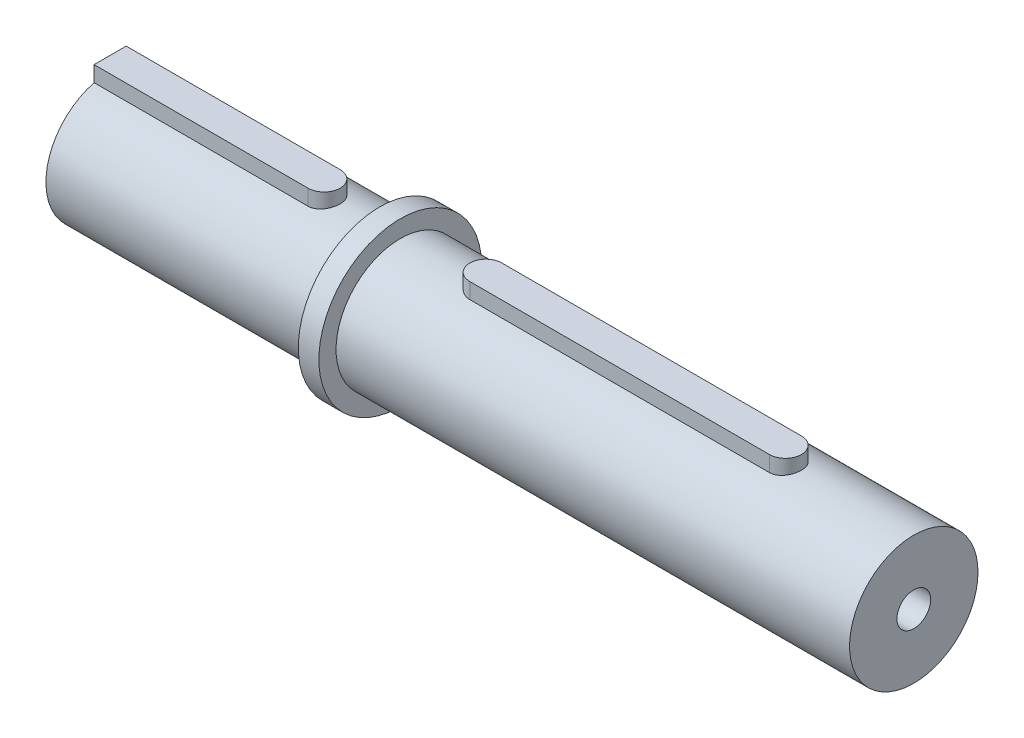
ISO-10303-21;
HEADER;
FILE_DESCRIPTION(('STEP AP214'),'2;1');
FILE_NAME('part.step','',(''),(''),'','','');
FILE_SCHEMA(('AUTOMOTIVE_DESIGN { 1 0 10303 214 1 1 1 1 }'));
ENDSEC;
DATA;
#1=APPLICATION_CONTEXT('core data for automotive mechanical design processes');
#2=APPLICATION_PROTOCOL_DEFINITION('international standard','automotive_design',2000,#1);
#3=PRODUCT_CONTEXT('',#1,'mechanical');
#4=PRODUCT('Part','Part','',(#3));
#5=PRODUCT_RELATED_PRODUCT_CATEGORY('part','',(#4));
#6=PRODUCT_DEFINITION_FORMATION('','',#4);
#7=PRODUCT_DEFINITION_CONTEXT('part definition',#1,'design');
#8=PRODUCT_DEFINITION('design','',#6,#7);
#9=PRODUCT_DEFINITION_SHAPE('','',#8);
#10=(LENGTH_UNIT() NAMED_UNIT(*) SI_UNIT(.MILLI.,.METRE.));
#11=(NAMED_UNIT(*) PLANE_ANGLE_UNIT() SI_UNIT($,.RADIAN.));
#12=(NAMED_UNIT(*) SI_UNIT($,.STERADIAN.) SOLID_ANGLE_UNIT());
#13=UNCERTAINTY_MEASURE_WITH_UNIT(LENGTH_MEASURE(1.E-05),#10,'distance_accuracy_value','');
#14=(GEOMETRIC_REPRESENTATION_CONTEXT(3) GLOBAL_UNCERTAINTY_ASSIGNED_CONTEXT((#13)) GLOBAL_UNIT_ASSIGNED_CONTEXT((#10,
#11,#12)) REPRESENTATION_CONTEXT('',''));
#15=CARTESIAN_POINT('',(0.,0.,0.));
#16=DIRECTION('',(0.,0.,1.));
#17=DIRECTION('',(1.,0.,0.));
#18=AXIS2_PLACEMENT_3D('',#15,#16,#17);
#19=CARTESIAN_POINT('',(-43.048,0.,0.));
#20=DIRECTION('',(1.,0.,0.));
#21=DIRECTION('',(0.,0.,-1.));
#22=AXIS2_PLACEMENT_3D('',#19,#20,#21);
#23=CYLINDRICAL_SURFACE('',#22,9.525);
#24=CARTESIAN_POINT('',(-3.048,0.,0.));
#25=DIRECTION('',(1.,0.,0.));
#26=DIRECTION('',(0.,0.,-1.));
#27=AXIS2_PLACEMENT_3D('',#24,#25,#26);
#28=CIRCLE('',#27,9.525);
#29=CARTESIAN_POINT('',(-3.048,0.,-9.525));
#30=VERTEX_POINT('',#29);
#31=EDGE_CURVE('E173',#30,#30,#28,.F.);
#32=ORIENTED_EDGE('',*,*,#31,.T.);
#33=EDGE_LOOP('',(#32));
#34=FACE_BOUND('',#33,.T.);
#35=DIRECTION('',(1.,0.,0.));
#36=VECTOR('',#35,1.);
#37=CARTESIAN_POINT('',(-43.048,9.22254159315641,2.38125));
#38=LINE('',#37,#36);
#39=CARTESIAN_POINT('',(-43.048,9.22254159315641,2.38125));
#40=VERTEX_POINT('',#39);
#41=CARTESIAN_POINT('',(-11.298,9.22254159315641,2.38125));
#42=VERTEX_POINT('',#41);
#43=EDGE_CURVE('E128',#40,#42,#38,.T.);
#44=ORIENTED_EDGE('',*,*,#43,.F.);
#45=CARTESIAN_POINT('',(-43.048,0.,0.));
#46=DIRECTION('',(-1.,0.,0.));
#47=DIRECTION('',(0.,0.,1.));
#48=AXIS2_PLACEMENT_3D('',#45,#46,#47);
#49=CIRCLE('',#48,9.525);
#50=CARTESIAN_POINT('',(-43.048,9.22254159315641,-2.38125));
#51=VERTEX_POINT('',#50);
#52=EDGE_CURVE('E126',#51,#40,#49,.T.);
#53=ORIENTED_EDGE('',*,*,#52,.F.);
#54=DIRECTION('',(1.,0.,0.));
#55=VECTOR('',#54,1.);
#56=CARTESIAN_POINT('',(-43.048,9.22254159315641,-2.38125));
#57=LINE('',#56,#55);
#58=CARTESIAN_POINT('',(-11.298,9.22254159315641,-2.38125));
#59=VERTEX_POINT('',#58);
#60=EDGE_CURVE('E58',#59,#51,#57,.F.);
#61=ORIENTED_EDGE('',*,*,#60,.F.);
#62=CARTESIAN_POINT('',(-11.298,9.22254159315641,-2.38125));
#63=CARTESIAN_POINT('',(-11.4294933402576,9.22254410333687,-2.3812462648599));
#64=CARTESIAN_POINT('',(-11.5610280159913,9.22538451478904,-2.37032124883651));
#65=CARTESIAN_POINT('',(-11.8203201182103,9.23641023547917,-2.32697952700426));
#66=CARTESIAN_POINT('',(-11.9480753011309,9.24459865537103,-2.29455031317185));
#67=CARTESIAN_POINT('',(-12.1960203701233,9.26533635177833,-2.20931536764952));
#68=CARTESIAN_POINT('',(-12.3162197905049,9.27787999662661,-2.1565359407814));
#69=CARTESIAN_POINT('',(-12.5460710870442,9.30590777907393,-2.03217888705147));
#70=CARTESIAN_POINT('',(-12.6557225151314,9.32139204150511,-1.96060046210405));
#71=CARTESIAN_POINT('',(-12.8637782171123,9.35393782328733,-1.79899477701457));
#72=CARTESIAN_POINT('',(-12.9619161543334,9.3710245423594,-1.70862963553811));
#73=CARTESIAN_POINT('',(-13.1418127281282,9.40463138928317,-1.51274341605588));
#74=CARTESIAN_POINT('',(-13.2235698334047,9.42115146404485,-1.40722092270674));
#75=CARTESIAN_POINT('',(-13.3694736329188,9.45204245783355,-1.1821908040277));
#76=CARTESIAN_POINT('',(-13.4333586847238,9.46638017249064,-1.06250858382585));
#77=CARTESIAN_POINT('',(-13.5400036860558,9.49100348359499,-0.813685683038856));
#78=CARTESIAN_POINT('',(-13.5827667524495,9.50128967785963,-0.684546401216823));
#79=CARTESIAN_POINT('',(-13.6451008124361,9.51647282802892,-0.423251717713339));
#80=CARTESIAN_POINT('',(-13.6651240862211,9.52147473886709,-0.291210415370399));
#81=CARTESIAN_POINT('',(-13.68282985626,9.52589148387201,-0.0255544503477878));
#82=CARTESIAN_POINT('',(-13.6805156555296,9.52530714407111,0.10805997679751));
#83=CARTESIAN_POINT('',(-13.6539374551367,9.51869535443241,0.369932538579247));
#84=CARTESIAN_POINT('',(-13.6301616503862,9.51278897229679,0.498243738400041));
#85=CARTESIAN_POINT('',(-13.5621198652788,9.49633771789926,0.748994201653841));
#86=CARTESIAN_POINT('',(-13.517852794178,9.48579259872026,0.871433152125855));
#87=CARTESIAN_POINT('',(-13.4096900514206,9.46106352990092,1.10824971271368));
#88=CARTESIAN_POINT('',(-13.3456206399597,9.44684756259498,1.22254448888149));
#89=CARTESIAN_POINT('',(-13.1998037156418,9.41631883378732,1.43893132569829));
#90=CARTESIAN_POINT('',(-13.118053127196,9.40000570769149,1.54102125854736));
#91=CARTESIAN_POINT('',(-12.9365774232618,9.36653937365312,1.73301192104605));
#92=CARTESIAN_POINT('',(-12.8364257150388,9.34937537847846,1.82250797329781));
#93=CARTESIAN_POINT('',(-12.6223560252029,9.31654578950254,1.98352499526195));
#94=CARTESIAN_POINT('',(-12.5084374005347,9.30088026575645,2.0550451248346));
#95=CARTESIAN_POINT('',(-12.2692737424732,9.27278273229926,2.17833923223503));
#96=CARTESIAN_POINT('',(-12.1439764668771,9.26036676990449,2.23001578134838));
#97=CARTESIAN_POINT('',(-11.8860873416568,9.24038004741607,2.31144513414038));
#98=CARTESIAN_POINT('',(-11.7534970595547,9.23280825052703,2.34120262935448));
#99=CARTESIAN_POINT('',(-11.4885385747928,9.22358476597103,2.37727773082929));
#100=CARTESIAN_POINT('',(-11.3562570018427,9.22178199750529,2.38419367640796));
#101=CARTESIAN_POINT('',(-11.0924296054025,9.22388944554869,2.37602743346569));
#102=CARTESIAN_POINT('',(-10.9608837153032,9.22779913615711,2.36094726995194));
#103=CARTESIAN_POINT('',(-10.7044836626365,9.24074620590693,2.30974150440119));
#104=CARTESIAN_POINT('',(-10.5795552279428,9.24969864156011,2.27396427503851));
#105=CARTESIAN_POINT('',(-10.3374690363947,9.27164184145322,2.18276622279111));
#106=CARTESIAN_POINT('',(-10.2203122019994,9.28463308404703,2.12734307294616));
#107=CARTESIAN_POINT('',(-9.99455968283178,9.31350820583475,1.99717406120961));
#108=CARTESIAN_POINT('',(-9.88617702985906,9.32944383098401,1.92207047052845));
#109=CARTESIAN_POINT('',(-9.6833330844316,9.36228521625235,1.75512482255016));
#110=CARTESIAN_POINT('',(-9.58887408439077,9.37919113548712,1.66328001450545));
#111=CARTESIAN_POINT('',(-9.4141349819512,9.41258026387764,1.46271310434488));
#112=CARTESIAN_POINT('',(-9.33426879042227,9.42904231213941,1.35362621196586));
#113=CARTESIAN_POINT('',(-9.19398858672894,9.45925098824539,1.1232420131667));
#114=CARTESIAN_POINT('',(-9.13357355993069,9.47299775771262,1.00194534408026));
#115=CARTESIAN_POINT('',(-9.03443515211215,9.49614035240754,0.751422967872161));
#116=CARTESIAN_POINT('',(-8.99555576912894,9.50556738096345,0.622262013572646));
#117=CARTESIAN_POINT('',(-8.94012403128549,9.51914491959489,0.35897286675916));
#118=CARTESIAN_POINT('',(-8.92356736755107,9.52329644797234,0.224845638004455));
#119=CARTESIAN_POINT('',(-8.91349342732325,9.5258136590472,-0.0406801473431621));
#120=CARTESIAN_POINT('',(-8.91936530521656,9.52433274707972,-0.172054425462838));
#121=CARTESIAN_POINT('',(-8.95258263874467,9.51609165939287,-0.431881350837625));
#122=CARTESIAN_POINT('',(-8.97992745575011,9.50933164068009,-0.560334084865836));
#123=CARTESIAN_POINT('',(-9.05498684832937,9.49131561983324,-0.810032278629118));
#124=CARTESIAN_POINT('',(-9.10259097320487,9.48008401721322,-0.931312815220679));
#125=CARTESIAN_POINT('',(-9.21671744129036,9.45430756725648,-1.16423373255537));
#126=CARTESIAN_POINT('',(-9.28324216929659,9.43976230230417,-1.27587289576379));
#127=CARTESIAN_POINT('',(-9.43518440095329,9.40849138301184,-1.48923834205799));
#128=CARTESIAN_POINT('',(-9.52101634028975,9.39172184092339,-1.59066306588541));
#129=CARTESIAN_POINT('',(-9.70833191627106,9.35808983067433,-1.77787701702628));
#130=CARTESIAN_POINT('',(-9.80981951523971,9.34122734003389,-1.86366227408863));
#131=CARTESIAN_POINT('',(-10.0278446175387,9.30896051857103,-2.01873332553605));
#132=CARTESIAN_POINT('',(-10.1446275687635,9.29358925997019,-2.08768144998525));
#133=CARTESIAN_POINT('',(-10.3884946352644,9.26649044022059,-2.20486342249415));
#134=CARTESIAN_POINT('',(-10.515571175511,9.2547602298034,-2.25311234134731));
#135=CARTESIAN_POINT('',(-10.7516865094325,9.23810482712693,-2.3203436461597));
#136=CARTESIAN_POINT('',(-10.8595955976945,9.23231253777082,-2.34313373748382));
#137=CARTESIAN_POINT('',(-11.0776602443007,9.22453003124864,-2.37358783418653));
#138=CARTESIAN_POINT('',(-11.187815610207,9.22253948975938,-2.38125312984773));
#139=CARTESIAN_POINT('',(-11.298,9.22254159315641,-2.38125));
#140=B_SPLINE_CURVE_WITH_KNOTS('',3,(#62,#63,#64,#65,#66,#67,#68,#69,#70,#71,#72,#73,#74,#75,
#76,#77,#78,#79,#80,#81,#82,#83,#84,#85,#86,#87,#88,#89,#90,#91,#92,#93,#94,#95,#96,#97,#98,#99,
#100,#101,#102,#103,#104,#105,#106,#107,#108,#109,#110,#111,#112,#113,#114,#115,#116,#117,#118,
#119,#120,#121,#122,#123,#124,#125,#126,#127,#128,#129,#130,#131,#132,#133,#134,#135,#136,#137,
#138,#139),.UNSPECIFIED.,.T.,.F.,(4,2,2,2,2,2,2,2,2,2,2,2,2,2,2,2,2,2,2,2,2,2,2,2,2,2,2,2,2,2,2,
2,2,2,2,2,2,2,4),(0.,0.39407538825367,0.788380193710805,1.18217701762564,1.57599056234593,
1.9776181636881,2.37928329209573,2.78655300319019,3.19376259754355,3.59272285323068,
3.99162411604385,4.38167395211222,4.77174455280359,5.16533962727359,5.5590032215914,
5.96332119409746,6.36765805967811,6.77395551488003,7.18016598123394,7.57564754962904,
7.97109271147281,8.3600677827598,8.7490889415861,9.14574160685558,9.54245950492715,
9.94910377749176,10.3557268347758,10.7593644935331,11.1629242284057,11.5555723244111,
11.9482087430628,12.3387314492783,12.7293033997022,13.1292323449913,13.5292626757086,
13.936755946198,14.343952021097,14.674194303944,15.0044084129029),.UNSPECIFIED.);
#141=EDGE_CURVE('E11',#42,#59,#140,.T.);
#142=ORIENTED_EDGE('',*,*,#141,.F.);
#143=EDGE_LOOP('',(#44,#53,#61,#142));
#144=FACE_BOUND('',#143,.T.);
#145=ADVANCED_FACE('F36',(#34,#144),#23,.T.);
#146=CARTESIAN_POINT('',(76.2,0.,0.));
#147=DIRECTION('',(-1.,0.,0.));
#148=DIRECTION('',(0.,0.,1.));
#149=AXIS2_PLACEMENT_3D('',#146,#147,#148);
#150=CYLINDRICAL_SURFACE('',#149,9.525);
#151=CARTESIAN_POINT('',(0.,0.,0.));
#152=DIRECTION('',(1.,0.,0.));
#153=DIRECTION('',(0.,0.,-1.));
#154=AXIS2_PLACEMENT_3D('',#151,#152,#153);
#155=CIRCLE('',#154,9.525);
#156=CARTESIAN_POINT('',(0.,0.,-9.525));
#157=VERTEX_POINT('',#156);
#158=EDGE_CURVE('E162',#157,#157,#155,.T.);
#159=ORIENTED_EDGE('',*,*,#158,.T.);
#160=EDGE_LOOP('',(#159));
#161=FACE_BOUND('',#160,.T.);
#162=CARTESIAN_POINT('',(76.2,0.,0.));
#163=DIRECTION('',(1.,0.,0.));
#164=DIRECTION('',(0.,0.,-1.));
#165=AXIS2_PLACEMENT_3D('',#162,#163,#164);
#166=CIRCLE('',#165,9.525);
#167=CARTESIAN_POINT('',(76.2,0.,-9.525));
#168=VERTEX_POINT('',#167);
#169=EDGE_CURVE('E163',#168,#168,#166,.T.);
#170=ORIENTED_EDGE('',*,*,#169,.F.);
#171=EDGE_LOOP('',(#170));
#172=FACE_BOUND('',#171,.T.);
#173=CARTESIAN_POINT('',(12.7,9.22254159315641,-2.38125));
#174=CARTESIAN_POINT('',(12.5685066597424,9.22254410333686,-2.3812462648599));
#175=CARTESIAN_POINT('',(12.4369719840087,9.22538451478904,-2.37032124883651));
#176=CARTESIAN_POINT('',(12.1776798817897,9.23641023547917,-2.32697952700426));
#177=CARTESIAN_POINT('',(12.0499246988691,9.24459865537103,-2.29455031317186));
#178=CARTESIAN_POINT('',(11.8019796298767,9.26533635177833,-2.20931536764952));
#179=CARTESIAN_POINT('',(11.6817802094951,9.27787999662661,-2.1565359407814));
#180=CARTESIAN_POINT('',(11.4519289129558,9.30590777907393,-2.03217888705147));
#181=CARTESIAN_POINT('',(11.3422774848686,9.32139204150511,-1.96060046210405));
#182=CARTESIAN_POINT('',(11.1342217828877,9.35393782328733,-1.79899477701457));
#183=CARTESIAN_POINT('',(11.0360838456666,9.3710245423594,-1.70862963553811));
#184=CARTESIAN_POINT('',(10.8561872718718,9.40463138928317,-1.51274341605588));
#185=CARTESIAN_POINT('',(10.7744301665953,9.42115146404485,-1.40722092270674));
#186=CARTESIAN_POINT('',(10.6285263670812,9.45204245783355,-1.18219080402771));
#187=CARTESIAN_POINT('',(10.5646413152762,9.46638017249064,-1.06250858382586));
#188=CARTESIAN_POINT('',(10.4579963139442,9.49100348359499,-0.81368568303886));
#189=CARTESIAN_POINT('',(10.4152332475505,9.50128967785963,-0.684546401216826));
#190=CARTESIAN_POINT('',(10.3528991875639,9.51647282802892,-0.423251717713341));
#191=CARTESIAN_POINT('',(10.3328759137789,9.52147473886709,-0.291210415370401));
#192=CARTESIAN_POINT('',(10.31517014374,9.52589148387201,-0.0255544503477896));
#193=CARTESIAN_POINT('',(10.3174843444704,9.52530714407111,0.108059976797509));
#194=CARTESIAN_POINT('',(10.3440625448633,9.51869535443241,0.369932538579246));
#195=CARTESIAN_POINT('',(10.3678383496138,9.51278897229679,0.498243738400039));
#196=CARTESIAN_POINT('',(10.4358801347212,9.49633771789926,0.748994201653839));
#197=CARTESIAN_POINT('',(10.480147205822,9.48579259872026,0.871433152125854));
#198=CARTESIAN_POINT('',(10.5883099485794,9.46106352990092,1.10824971271368));
#199=CARTESIAN_POINT('',(10.6523793600403,9.44684756259498,1.22254448888149));
#200=CARTESIAN_POINT('',(10.7981962843582,9.41631883378732,1.43893132569829));
#201=CARTESIAN_POINT('',(10.879946872804,9.40000570769149,1.54102125854736));
#202=CARTESIAN_POINT('',(11.0614225767382,9.36653937365312,1.73301192104605));
#203=CARTESIAN_POINT('',(11.1615742849612,9.34937537847846,1.82250797329781));
#204=CARTESIAN_POINT('',(11.3756439747971,9.31654578950254,1.98352499526194));
#205=CARTESIAN_POINT('',(11.4895625994653,9.30088026575645,2.0550451248346));
#206=CARTESIAN_POINT('',(11.7287262575268,9.27278273229926,2.17833923223503));
#207=CARTESIAN_POINT('',(11.8540235331229,9.2603667699045,2.23001578134838));
#208=CARTESIAN_POINT('',(12.1119126583432,9.24038004741607,2.31144513414038));
#209=CARTESIAN_POINT('',(12.2445029404453,9.23280825052703,2.34120262935448));
#210=CARTESIAN_POINT('',(12.5094614252073,9.22358476597102,2.37727773082929));
#211=CARTESIAN_POINT('',(12.6417429981573,9.22178199750529,2.38419367640796));
#212=CARTESIAN_POINT('',(12.9055703945975,9.22388944554869,2.37602743346569));
#213=CARTESIAN_POINT('',(13.0371162846968,9.22779913615711,2.36094726995194));
#214=CARTESIAN_POINT('',(13.2935163373635,9.24074620590693,2.30974150440119));
#215=CARTESIAN_POINT('',(13.4184447720572,9.24969864156011,2.27396427503851));
#216=CARTESIAN_POINT('',(13.6605309636053,9.27164184145322,2.18276622279111));
#217=CARTESIAN_POINT('',(13.7776877980006,9.28463308404703,2.12734307294616));
#218=CARTESIAN_POINT('',(14.0034403171682,9.31350820583475,1.99717406120961));
#219=CARTESIAN_POINT('',(14.1118229701409,9.32944383098401,1.92207047052845));
#220=CARTESIAN_POINT('',(14.3146669155684,9.36228521625235,1.75512482255016));
#221=CARTESIAN_POINT('',(14.4091259156092,9.37919113548712,1.66328001450545));
#222=CARTESIAN_POINT('',(14.5838650180488,9.41258026387764,1.46271310434488));
#223=CARTESIAN_POINT('',(14.6637312095777,9.42904231213941,1.35362621196585));
#224=CARTESIAN_POINT('',(14.8040114132711,9.45925098824539,1.12324201316669));
#225=CARTESIAN_POINT('',(14.8644264400693,9.47299775771262,1.00194534408026));
#226=CARTESIAN_POINT('',(14.9635648478879,9.49614035240754,0.751422967872157));
#227=CARTESIAN_POINT('',(15.0024442308711,9.50556738096345,0.622262013572642));
#228=CARTESIAN_POINT('',(15.0578759687145,9.51914491959489,0.358972866759157));
#229=CARTESIAN_POINT('',(15.0744326324489,9.52329644797234,0.224845638004452));
#230=CARTESIAN_POINT('',(15.0845065726768,9.5258136590472,-0.0406801473431651));
#231=CARTESIAN_POINT('',(15.0786346947834,9.52433274707972,-0.172054425462841));
#232=CARTESIAN_POINT('',(15.0454173612553,9.51609165939287,-0.431881350837627));
#233=CARTESIAN_POINT('',(15.0180725442499,9.50933164068009,-0.560334084865838));
#234=CARTESIAN_POINT('',(14.9430131516706,9.49131561983324,-0.810032278629119));
#235=CARTESIAN_POINT('',(14.8954090267951,9.48008401721322,-0.93131281522068));
#236=CARTESIAN_POINT('',(14.7812825587097,9.45430756725648,-1.16423373255537));
#237=CARTESIAN_POINT('',(14.7147578307034,9.43976230230417,-1.27587289576379));
#238=CARTESIAN_POINT('',(14.5628155990467,9.40849138301184,-1.48923834205799));
#239=CARTESIAN_POINT('',(14.4769836597103,9.39172184092339,-1.59066306588541));
#240=CARTESIAN_POINT('',(14.289668083729,9.35808983067433,-1.77787701702628));
#241=CARTESIAN_POINT('',(14.1881804847603,9.34122734003389,-1.86366227408863));
#242=CARTESIAN_POINT('',(13.9701553824614,9.30896051857103,-2.01873332553605));
#243=CARTESIAN_POINT('',(13.8533724312365,9.29358925997019,-2.08768144998525));
#244=CARTESIAN_POINT('',(13.6095053647356,9.26649044022059,-2.20486342249415));
#245=CARTESIAN_POINT('',(13.482428824489,9.2547602298034,-2.25311234134731));
#246=CARTESIAN_POINT('',(13.2463134905675,9.23810482712693,-2.3203436461597));
#247=CARTESIAN_POINT('',(13.1384044023055,9.23231253777082,-2.34313373748382));
#248=CARTESIAN_POINT('',(12.9203397556993,9.22453003124864,-2.37358783418653));
#249=CARTESIAN_POINT('',(12.810184389793,9.22253948975938,-2.38125312984773));
#250=CARTESIAN_POINT('',(12.7,9.22254159315641,-2.38125));
#251=B_SPLINE_CURVE_WITH_KNOTS('',3,(#173,#174,#175,#176,#177,#178,#179,#180,#181,#182,#183,
#184,#185,#186,#187,#188,#189,#190,#191,#192,#193,#194,#195,#196,#197,#198,#199,#200,#201,#202,
#203,#204,#205,#206,#207,#208,#209,#210,#211,#212,#213,#214,#215,#216,#217,#218,#219,#220,#221,
#222,#223,#224,#225,#226,#227,#228,#229,#230,#231,#232,#233,#234,#235,#236,#237,#238,#239,#240,
#241,#242,#243,#244,#245,#246,#247,#248,#249,#250),.UNSPECIFIED.,.T.,.F.,(4,2,2,2,2,2,2,2,2,2,2,
2,2,2,2,2,2,2,2,2,2,2,2,2,2,2,2,2,2,2,2,2,2,2,2,2,2,2,4),(0.,0.39407538825367,0.788380193710805,
1.18217701762564,1.57599056234593,1.9776181636881,2.37928329209573,2.78655300319019,
3.19376259754355,3.59272285323067,3.99162411604384,4.38167395211222,4.77174455280359,
5.16533962727358,5.5590032215914,5.96332119409746,6.36765805967811,6.77395551488003,
7.18016598123394,7.57564754962904,7.97109271147282,8.3600677827598,8.7490889415861,
9.14574160685558,9.54245950492715,9.94910377749177,10.3557268347758,10.7593644935331,
11.1629242284057,11.5555723244111,11.9482087430628,12.3387314492783,12.7293033997022,
13.1292323449913,13.5292626757086,13.936755946198,14.343952021097,14.674194303944,
15.0044084129029),.UNSPECIFIED.);
#252=CARTESIAN_POINT('',(12.7,9.22254159315641,-2.38125));
#253=VERTEX_POINT('',#252);
#254=CARTESIAN_POINT('',(12.7,9.22254159315641,2.38125));
#255=VERTEX_POINT('',#254);
#256=EDGE_CURVE('E48',#253,#255,#251,.T.);
#257=ORIENTED_EDGE('',*,*,#256,.F.);
#258=DIRECTION('',(-1.,0.,0.));
#259=VECTOR('',#258,1.);
#260=CARTESIAN_POINT('',(76.2,9.22254159315641,-2.38125));
#261=LINE('',#260,#259);
#262=CARTESIAN_POINT('',(57.15,9.22254159315641,-2.38125));
#263=VERTEX_POINT('',#262);
#264=EDGE_CURVE('E178',#263,#253,#261,.T.);
#265=ORIENTED_EDGE('',*,*,#264,.F.);
#266=CARTESIAN_POINT('',(57.15,9.22254159315641,-2.38125));
#267=CARTESIAN_POINT('',(57.0185066597424,9.22254410333686,-2.3812462648599));
#268=CARTESIAN_POINT('',(56.8869719840087,9.22538451478904,-2.37032124883651));
#269=CARTESIAN_POINT('',(56.6276798817897,9.23641023547917,-2.32697952700426));
#270=CARTESIAN_POINT('',(56.4999246988691,9.24459865537103,-2.29455031317186));
#271=CARTESIAN_POINT('',(56.2519796298767,9.26533635177833,-2.20931536764952));
#272=CARTESIAN_POINT('',(56.1317802094951,9.27787999662661,-2.15653594078141));
#273=CARTESIAN_POINT('',(55.9019289129558,9.30590777907392,-2.03217888705147));
#274=CARTESIAN_POINT('',(55.7922774848686,9.32139204150511,-1.96060046210406));
#275=CARTESIAN_POINT('',(55.5842217828878,9.35393782328733,-1.79899477701457));
#276=CARTESIAN_POINT('',(55.4860838456666,9.3710245423594,-1.70862963553811));
#277=CARTESIAN_POINT('',(55.3061872718718,9.40463138928317,-1.51274341605588));
#278=CARTESIAN_POINT('',(55.2244301665953,9.42115146404485,-1.40722092270674));
#279=CARTESIAN_POINT('',(55.0785263670812,9.45204245783355,-1.18219080402771));
#280=CARTESIAN_POINT('',(55.0146413152762,9.46638017249064,-1.06250858382586));
#281=CARTESIAN_POINT('',(54.9079963139442,9.49100348359499,-0.813685683038862));
#282=CARTESIAN_POINT('',(54.8652332475505,9.50128967785963,-0.68454640121683));
#283=CARTESIAN_POINT('',(54.8028991875639,9.51647282802892,-0.423251717713347));
#284=CARTESIAN_POINT('',(54.7828759137789,9.52147473886709,-0.291210415370406));
#285=CARTESIAN_POINT('',(54.76517014374,9.52589148387201,-0.0255544503477941));
#286=CARTESIAN_POINT('',(54.7674843444704,9.52530714407111,0.108059976797504));
#287=CARTESIAN_POINT('',(54.7940625448633,9.51869535443241,0.369932538579242));
#288=CARTESIAN_POINT('',(54.8178383496138,9.51278897229679,0.498243738400036));
#289=CARTESIAN_POINT('',(54.8858801347212,9.49633771789926,0.748994201653836));
#290=CARTESIAN_POINT('',(54.930147205822,9.48579259872026,0.871433152125851));
#291=CARTESIAN_POINT('',(55.0383099485794,9.46106352990092,1.10824971271367));
#292=CARTESIAN_POINT('',(55.1023793600403,9.44684756259498,1.22254448888148));
#293=CARTESIAN_POINT('',(55.2481962843582,9.41631883378732,1.43893132569828));
#294=CARTESIAN_POINT('',(55.329946872804,9.40000570769149,1.54102125854736));
#295=CARTESIAN_POINT('',(55.5114225767382,9.36653937365312,1.73301192104605));
#296=CARTESIAN_POINT('',(55.6115742849612,9.34937537847846,1.82250797329781));
#297=CARTESIAN_POINT('',(55.8256439747971,9.31654578950254,1.98352499526194));
#298=CARTESIAN_POINT('',(55.9395625994653,9.30088026575645,2.0550451248346));
#299=CARTESIAN_POINT('',(56.1787262575268,9.27278273229926,2.17833923223503));
#300=CARTESIAN_POINT('',(56.304023533123,9.26036676990449,2.23001578134838));
#301=CARTESIAN_POINT('',(56.5619126583432,9.24038004741607,2.31144513414038));
#302=CARTESIAN_POINT('',(56.6945029404453,9.23280825052703,2.34120262935448));
#303=CARTESIAN_POINT('',(56.9594614252073,9.22358476597103,2.37727773082929));
#304=CARTESIAN_POINT('',(57.0917429981573,9.22178199750529,2.38419367640796));
#305=CARTESIAN_POINT('',(57.3555703945974,9.22388944554869,2.37602743346569));
#306=CARTESIAN_POINT('',(57.4871162846968,9.22779913615711,2.36094726995194));
#307=CARTESIAN_POINT('',(57.7435163373635,9.24074620590693,2.30974150440119));
#308=CARTESIAN_POINT('',(57.8684447720572,9.24969864156011,2.27396427503852));
#309=CARTESIAN_POINT('',(58.1105309636053,9.27164184145322,2.18276622279112));
#310=CARTESIAN_POINT('',(58.2276877980006,9.28463308404703,2.12734307294616));
#311=CARTESIAN_POINT('',(58.4534403171682,9.31350820583475,1.99717406120961));
#312=CARTESIAN_POINT('',(58.5618229701409,9.32944383098401,1.92207047052845));
#313=CARTESIAN_POINT('',(58.7646669155684,9.36228521625235,1.75512482255016));
#314=CARTESIAN_POINT('',(58.8591259156092,9.37919113548712,1.66328001450545));
#315=CARTESIAN_POINT('',(59.0338650180488,9.41258026387764,1.46271310434488));
#316=CARTESIAN_POINT('',(59.1137312095777,9.42904231213941,1.35362621196586));
#317=CARTESIAN_POINT('',(59.2540114132711,9.45925098824539,1.1232420131667));
#318=CARTESIAN_POINT('',(59.3144264400693,9.47299775771262,1.00194534408027));
#319=CARTESIAN_POINT('',(59.4135648478879,9.49614035240754,0.751422967872164));
#320=CARTESIAN_POINT('',(59.4524442308711,9.50556738096345,0.622262013572649));
#321=CARTESIAN_POINT('',(59.5078759687145,9.51914491959489,0.358972866759163));
#322=CARTESIAN_POINT('',(59.5244326324489,9.52329644797234,0.224845638004458));
#323=CARTESIAN_POINT('',(59.5345065726768,9.52581365904719,-0.0406801473431597));
#324=CARTESIAN_POINT('',(59.5286346947834,9.52433274707973,-0.172054425462835));
#325=CARTESIAN_POINT('',(59.4954173612553,9.51609165939287,-0.431881350837621));
#326=CARTESIAN_POINT('',(59.4680725442499,9.50933164068009,-0.560334084865833));
#327=CARTESIAN_POINT('',(59.3930131516706,9.49131561983324,-0.810032278629115));
#328=CARTESIAN_POINT('',(59.3454090267951,9.48008401721322,-0.931312815220676));
#329=CARTESIAN_POINT('',(59.2312825587097,9.45430756725648,-1.16423373255536));
#330=CARTESIAN_POINT('',(59.1647578307034,9.43976230230417,-1.27587289576379));
#331=CARTESIAN_POINT('',(59.0128155990467,9.40849138301184,-1.48923834205799));
#332=CARTESIAN_POINT('',(58.9269836597103,9.39172184092339,-1.59066306588541));
#333=CARTESIAN_POINT('',(58.739668083729,9.35808983067433,-1.77787701702628));
#334=CARTESIAN_POINT('',(58.6381804847603,9.34122734003389,-1.86366227408863));
#335=CARTESIAN_POINT('',(58.4201553824614,9.30896051857103,-2.01873332553605));
#336=CARTESIAN_POINT('',(58.3033724312365,9.29358925997019,-2.08768144998525));
#337=CARTESIAN_POINT('',(58.0595053647356,9.26649044022059,-2.20486342249415));
#338=CARTESIAN_POINT('',(57.9324288244891,9.2547602298034,-2.25311234134731));
#339=CARTESIAN_POINT('',(57.6963134905675,9.23810482712693,-2.3203436461597));
#340=CARTESIAN_POINT('',(57.5884044023055,9.23231253777082,-2.34313373748382));
#341=CARTESIAN_POINT('',(57.3703397556993,9.22453003124864,-2.37358783418653));
#342=CARTESIAN_POINT('',(57.260184389793,9.22253948975938,-2.38125312984773));
#343=CARTESIAN_POINT('',(57.15,9.22254159315641,-2.38125));
#344=B_SPLINE_CURVE_WITH_KNOTS('',3,(#266,#267,#268,#269,#270,#271,#272,#273,#274,#275,#276,
#277,#278,#279,#280,#281,#282,#283,#284,#285,#286,#287,#288,#289,#290,#291,#292,#293,#294,#295,
#296,#297,#298,#299,#300,#301,#302,#303,#304,#305,#306,#307,#308,#309,#310,#311,#312,#313,#314,
#315,#316,#317,#318,#319,#320,#321,#322,#323,#324,#325,#326,#327,#328,#329,#330,#331,#332,#333,
#334,#335,#336,#337,#338,#339,#340,#341,#342,#343),.UNSPECIFIED.,.T.,.F.,(4,2,2,2,2,2,2,2,2,2,2,
2,2,2,2,2,2,2,2,2,2,2,2,2,2,2,2,2,2,2,2,2,2,2,2,2,2,2,4),(0.,0.394075388253673,
0.788380193710801,1.18217701762563,1.57599056234593,1.97761816368809,2.37928329209573,
2.78655300319018,3.19376259754355,3.59272285323067,3.99162411604384,4.38167395211222,
4.77174455280358,5.16533962727358,5.5590032215914,5.96332119409745,6.36765805967812,
6.77395551488004,7.18016598123395,7.57564754962905,7.97109271147281,8.36006778275979,
8.7490889415861,9.14574160685557,9.54245950492715,9.94910377749177,10.3557268347758,
10.7593644935331,11.1629242284057,11.5555723244111,11.9482087430628,12.3387314492783,
12.7293033997022,13.1292323449913,13.5292626757086,13.936755946198,14.343952021097,
14.674194303944,15.0044084129029),.UNSPECIFIED.);
#345=CARTESIAN_POINT('',(57.15,9.22254159315641,2.38125));
#346=VERTEX_POINT('',#345);
#347=EDGE_CURVE('E181',#346,#263,#344,.T.);
#348=ORIENTED_EDGE('',*,*,#347,.F.);
#349=DIRECTION('',(-1.,0.,0.));
#350=VECTOR('',#349,1.);
#351=CARTESIAN_POINT('',(76.2,9.22254159315641,2.38125));
#352=LINE('',#351,#350);
#353=EDGE_CURVE('E188',#255,#346,#352,.F.);
#354=ORIENTED_EDGE('',*,*,#353,.F.);
#355=EDGE_LOOP('',(#257,#265,#348,#354));
#356=FACE_BOUND('',#355,.T.);
#357=ADVANCED_FACE('F189',(#161,#172,#356),#150,.T.);
#358=CARTESIAN_POINT('',(0.,0.,0.));
#359=DIRECTION('',(1.,0.,0.));
#360=DIRECTION('',(0.,0.,-1.));
#361=AXIS2_PLACEMENT_3D('',#358,#359,#360);
#362=PLANE('',#361);
#363=CARTESIAN_POINT('',(0.,0.,0.));
#364=DIRECTION('',(1.,0.,0.));
#365=DIRECTION('',(0.,0.,-1.));
#366=AXIS2_PLACEMENT_3D('',#363,#364,#365);
#367=CIRCLE('',#366,12.0777);
#368=CARTESIAN_POINT('',(0.,0.,-12.0777));
#369=VERTEX_POINT('',#368);
#370=EDGE_CURVE('E169',#369,#369,#367,.T.);
#371=ORIENTED_EDGE('',*,*,#370,.T.);
#372=EDGE_LOOP('',(#371));
#373=FACE_BOUND('',#372,.T.);
#374=ORIENTED_EDGE('',*,*,#158,.F.);
#375=EDGE_LOOP('',(#374));
#376=FACE_BOUND('',#375,.T.);
#377=ADVANCED_FACE('F228',(#373,#376),#362,.T.);
#378=CARTESIAN_POINT('',(-3.048,0.,0.));
#379=DIRECTION('',(1.,0.,0.));
#380=DIRECTION('',(0.,0.,-1.));
#381=AXIS2_PLACEMENT_3D('',#378,#379,#380);
#382=PLANE('',#381);
#383=CARTESIAN_POINT('',(-3.048,0.,0.));
#384=DIRECTION('',(1.,0.,0.));
#385=DIRECTION('',(0.,0.,-1.));
#386=AXIS2_PLACEMENT_3D('',#383,#384,#385);
#387=CIRCLE('',#386,12.0777);
#388=CARTESIAN_POINT('',(-3.048,0.,-12.0777));
#389=VERTEX_POINT('',#388);
#390=EDGE_CURVE('E170',#389,#389,#387,.T.);
#391=ORIENTED_EDGE('',*,*,#390,.F.);
#392=EDGE_LOOP('',(#391));
#393=FACE_BOUND('',#392,.T.);
#394=ORIENTED_EDGE('',*,*,#31,.F.);
#395=EDGE_LOOP('',(#394));
#396=FACE_BOUND('',#395,.T.);
#397=ADVANCED_FACE('F234',(#393,#396),#382,.F.);
#398=CARTESIAN_POINT('',(-3.048,0.,0.));
#399=DIRECTION('',(1.,0.,0.));
#400=DIRECTION('',(0.,0.,-1.));
#401=AXIS2_PLACEMENT_3D('',#398,#399,#400);
#402=CYLINDRICAL_SURFACE('',#401,12.0777);
#403=ORIENTED_EDGE('',*,*,#390,.T.);
#404=EDGE_LOOP('',(#403));
#405=FACE_BOUND('',#404,.T.);
#406=ORIENTED_EDGE('',*,*,#370,.F.);
#407=EDGE_LOOP('',(#406));
#408=FACE_BOUND('',#407,.T.);
#409=ADVANCED_FACE('F38',(#405,#408),#402,.T.);
#410=CARTESIAN_POINT('',(-43.048,0.,0.));
#411=DIRECTION('',(-1.,0.,0.));
#412=DIRECTION('',(0.,0.,1.));
#413=AXIS2_PLACEMENT_3D('',#410,#411,#412);
#414=PLANE('',#413);
#415=ORIENTED_EDGE('',*,*,#52,.T.);
#416=DIRECTION('',(0.,-1.,0.));
#417=VECTOR('',#416,1.);
#418=CARTESIAN_POINT('',(-43.048,11.5443,2.38125));
#419=LINE('',#418,#417);
#420=CARTESIAN_POINT('',(-43.048,11.5443,2.38125));
#421=VERTEX_POINT('',#420);
#422=EDGE_CURVE('E108',#421,#40,#419,.T.);
#423=ORIENTED_EDGE('',*,*,#422,.F.);
#424=DIRECTION('',(0.,0.,1.));
#425=VECTOR('',#424,1.);
#426=CARTESIAN_POINT('',(-43.048,11.5443,-2.38125));
#427=LINE('',#426,#425);
#428=CARTESIAN_POINT('',(-43.048,11.5443,-2.38125));
#429=VERTEX_POINT('',#428);
#430=EDGE_CURVE('E114',#429,#421,#427,.T.);
#431=ORIENTED_EDGE('',*,*,#430,.F.);
#432=DIRECTION('',(0.,-1.,0.));
#433=VECTOR('',#432,1.);
#434=CARTESIAN_POINT('',(-43.048,11.5443,-2.38125));
#435=LINE('',#434,#433);
#436=EDGE_CURVE('E392',#429,#51,#435,.T.);
#437=ORIENTED_EDGE('',*,*,#436,.T.);
#438=EDGE_LOOP('',(#415,#423,#431,#437));
#439=FACE_BOUND('',#438,.T.);
#440=ADVANCED_FACE('F125',(#439),#414,.T.);
#441=CARTESIAN_POINT('',(76.2,0.,0.));
#442=DIRECTION('',(1.,0.,0.));
#443=DIRECTION('',(0.,0.,-1.));
#444=AXIS2_PLACEMENT_3D('',#441,#442,#443);
#445=PLANE('',#444);
#446=CARTESIAN_POINT('',(76.2,0.,0.));
#447=DIRECTION('',(1.,0.,0.));
#448=DIRECTION('',(0.,0.,-1.));
#449=AXIS2_PLACEMENT_3D('',#446,#447,#448);
#450=CIRCLE('',#449,2.49999999999999);
#451=CARTESIAN_POINT('',(76.2,0.,-2.49999999999999));
#452=VERTEX_POINT('',#451);
#453=EDGE_CURVE('E156',#452,#452,#450,.T.);
#454=ORIENTED_EDGE('',*,*,#453,.F.);
#455=EDGE_LOOP('',(#454));
#456=FACE_BOUND('',#455,.T.);
#457=ORIENTED_EDGE('',*,*,#169,.T.);
#458=EDGE_LOOP('',(#457));
#459=FACE_BOUND('',#458,.T.);
#460=ADVANCED_FACE('F241',(#456,#459),#445,.T.);
#461=CARTESIAN_POINT('',(61.214,0.,0.));
#462=DIRECTION('',(1.,0.,0.));
#463=DIRECTION('',(0.,0.,-1.));
#464=AXIS2_PLACEMENT_3D('',#461,#462,#463);
#465=CONICAL_SURFACE('',#464,2.49999999999999,1.02974425867665);
#466=CARTESIAN_POINT('',(59.7118484524311,0.,0.));
#467=VERTEX_POINT('',#466);
#468=VERTEX_LOOP('',#467);
#469=FACE_BOUND('',#468,.T.);
#470=CARTESIAN_POINT('',(61.214,0.,0.));
#471=DIRECTION('',(1.,0.,0.));
#472=DIRECTION('',(0.,0.,-1.));
#473=AXIS2_PLACEMENT_3D('',#470,#471,#472);
#474=CIRCLE('',#473,2.49999999999999);
#475=CARTESIAN_POINT('',(61.214,0.,-2.49999999999999));
#476=VERTEX_POINT('',#475);
#477=EDGE_CURVE('E159',#476,#476,#474,.T.);
#478=ORIENTED_EDGE('',*,*,#477,.T.);
#479=EDGE_LOOP('',(#478));
#480=FACE_BOUND('',#479,.T.);
#481=ADVANCED_FACE('F243',(#469,#480),#465,.F.);
#482=CARTESIAN_POINT('',(76.2,0.,0.));
#483=DIRECTION('',(1.,0.,0.));
#484=DIRECTION('',(0.,0.,-1.));
#485=AXIS2_PLACEMENT_3D('',#482,#483,#484);
#486=CYLINDRICAL_SURFACE('',#485,2.49999999999999);
#487=ORIENTED_EDGE('',*,*,#477,.F.);
#488=EDGE_LOOP('',(#487));
#489=FACE_BOUND('',#488,.T.);
#490=ORIENTED_EDGE('',*,*,#453,.T.);
#491=EDGE_LOOP('',(#490));
#492=FACE_BOUND('',#491,.T.);
#493=ADVANCED_FACE('F209',(#489,#492),#486,.F.);
#494=CARTESIAN_POINT('',(12.7,11.5443,0.));
#495=DIRECTION('',(0.,-1.,0.));
#496=DIRECTION('',(0.,0.,-1.));
#497=AXIS2_PLACEMENT_3D('',#494,#495,#496);
#498=CYLINDRICAL_SURFACE('',#497,2.38125);
#499=DIRECTION('',(0.,-1.,0.));
#500=VECTOR('',#499,1.);
#501=CARTESIAN_POINT('',(12.7,11.5443,-2.38125));
#502=LINE('',#501,#500);
#503=CARTESIAN_POINT('',(12.7,11.5443,-2.38125));
#504=VERTEX_POINT('',#503);
#505=EDGE_CURVE('E144',#504,#253,#502,.T.);
#506=ORIENTED_EDGE('',*,*,#505,.T.);
#507=ORIENTED_EDGE('',*,*,#256,.T.);
#508=DIRECTION('',(0.,-1.,0.));
#509=VECTOR('',#508,1.);
#510=CARTESIAN_POINT('',(12.7,11.5443,2.38125));
#511=LINE('',#510,#509);
#512=CARTESIAN_POINT('',(12.7,11.5443,2.38125));
#513=VERTEX_POINT('',#512);
#514=EDGE_CURVE('E153',#513,#255,#511,.T.);
#515=ORIENTED_EDGE('',*,*,#514,.F.);
#516=CARTESIAN_POINT('',(12.7,11.5443,0.));
#517=DIRECTION('',(0.,1.,0.));
#518=DIRECTION('',(0.,0.,1.));
#519=AXIS2_PLACEMENT_3D('',#516,#517,#518);
#520=CIRCLE('',#519,2.38125);
#521=EDGE_CURVE('E135',#504,#513,#520,.T.);
#522=ORIENTED_EDGE('',*,*,#521,.F.);
#523=EDGE_LOOP('',(#506,#507,#515,#522));
#524=FACE_BOUND('',#523,.T.);
#525=ADVANCED_FACE('F204',(#524),#498,.T.);
#526=CARTESIAN_POINT('',(12.7,11.5443,2.38125));
#527=DIRECTION('',(0.,0.,-1.));
#528=DIRECTION('',(-1.,0.,0.));
#529=AXIS2_PLACEMENT_3D('',#526,#527,#528);
#530=PLANE('',#529);
#531=ORIENTED_EDGE('',*,*,#514,.T.);
#532=ORIENTED_EDGE('',*,*,#353,.T.);
#533=DIRECTION('',(0.,-1.,0.));
#534=VECTOR('',#533,1.);
#535=CARTESIAN_POINT('',(57.15,11.5443,2.38125));
#536=LINE('',#535,#534);
#537=CARTESIAN_POINT('',(57.15,11.5443,2.38125));
#538=VERTEX_POINT('',#537);
#539=EDGE_CURVE('E150',#538,#346,#536,.T.);
#540=ORIENTED_EDGE('',*,*,#539,.F.);
#541=DIRECTION('',(1.,0.,0.));
#542=VECTOR('',#541,1.);
#543=CARTESIAN_POINT('',(12.7,11.5443,2.38125));
#544=LINE('',#543,#542);
#545=EDGE_CURVE('E138',#513,#538,#544,.T.);
#546=ORIENTED_EDGE('',*,*,#545,.F.);
#547=EDGE_LOOP('',(#531,#532,#540,#546));
#548=FACE_BOUND('',#547,.T.);
#549=ADVANCED_FACE('F199',(#548),#530,.F.);
#550=CARTESIAN_POINT('',(57.15,11.5443,0.));
#551=DIRECTION('',(0.,-1.,0.));
#552=DIRECTION('',(0.,0.,-1.));
#553=AXIS2_PLACEMENT_3D('',#550,#551,#552);
#554=CYLINDRICAL_SURFACE('',#553,2.38125);
#555=ORIENTED_EDGE('',*,*,#539,.T.);
#556=ORIENTED_EDGE('',*,*,#347,.T.);
#557=DIRECTION('',(0.,-1.,0.));
#558=VECTOR('',#557,1.);
#559=CARTESIAN_POINT('',(57.15,11.5443,-2.38125));
#560=LINE('',#559,#558);
#561=CARTESIAN_POINT('',(57.15,11.5443,-2.38125));
#562=VERTEX_POINT('',#561);
#563=EDGE_CURVE('E147',#562,#263,#560,.T.);
#564=ORIENTED_EDGE('',*,*,#563,.F.);
#565=CARTESIAN_POINT('',(57.15,11.5443,0.));
#566=DIRECTION('',(0.,1.,0.));
#567=DIRECTION('',(0.,0.,1.));
#568=AXIS2_PLACEMENT_3D('',#565,#566,#567);
#569=CIRCLE('',#568,2.38125);
#570=EDGE_CURVE('E140',#538,#562,#569,.T.);
#571=ORIENTED_EDGE('',*,*,#570,.F.);
#572=EDGE_LOOP('',(#555,#556,#564,#571));
#573=FACE_BOUND('',#572,.T.);
#574=ADVANCED_FACE('F193',(#573),#554,.T.);
#575=CARTESIAN_POINT('',(12.7,11.5443,-2.38125));
#576=DIRECTION('',(0.,0.,1.));
#577=DIRECTION('',(1.,0.,0.));
#578=AXIS2_PLACEMENT_3D('',#575,#576,#577);
#579=PLANE('',#578);
#580=ORIENTED_EDGE('',*,*,#563,.T.);
#581=ORIENTED_EDGE('',*,*,#264,.T.);
#582=ORIENTED_EDGE('',*,*,#505,.F.);
#583=DIRECTION('',(-1.,0.,0.));
#584=VECTOR('',#583,1.);
#585=CARTESIAN_POINT('',(12.7,11.5443,-2.38125));
#586=LINE('',#585,#584);
#587=EDGE_CURVE('E142',#562,#504,#586,.T.);
#588=ORIENTED_EDGE('',*,*,#587,.F.);
#589=EDGE_LOOP('',(#580,#581,#582,#588));
#590=FACE_BOUND('',#589,.T.);
#591=ADVANCED_FACE('F198',(#590),#579,.F.);
#592=CARTESIAN_POINT('',(12.7,11.5443,0.));
#593=DIRECTION('',(0.,1.,0.));
#594=DIRECTION('',(0.,0.,1.));
#595=AXIS2_PLACEMENT_3D('',#592,#593,#594);
#596=PLANE('',#595);
#597=ORIENTED_EDGE('',*,*,#521,.T.);
#598=ORIENTED_EDGE('',*,*,#545,.T.);
#599=ORIENTED_EDGE('',*,*,#570,.T.);
#600=ORIENTED_EDGE('',*,*,#587,.T.);
#601=EDGE_LOOP('',(#597,#598,#599,#600));
#602=FACE_BOUND('',#601,.T.);
#603=ADVANCED_FACE('F223',(#602),#596,.T.);
#604=CARTESIAN_POINT('',(-11.298,11.5443,0.));
#605=DIRECTION('',(0.,-1.,0.));
#606=DIRECTION('',(0.,0.,-1.));
#607=AXIS2_PLACEMENT_3D('',#604,#605,#606);
#608=CYLINDRICAL_SURFACE('',#607,2.38125);
#609=DIRECTION('',(0.,-1.,0.));
#610=VECTOR('',#609,1.);
#611=CARTESIAN_POINT('',(-11.298,11.5443,2.38125));
#612=LINE('',#611,#610);
#613=CARTESIAN_POINT('',(-11.298,11.5443,2.38125));
#614=VERTEX_POINT('',#613);
#615=EDGE_CURVE('E110',#614,#42,#612,.T.);
#616=ORIENTED_EDGE('',*,*,#615,.T.);
#617=ORIENTED_EDGE('',*,*,#141,.T.);
#618=DIRECTION('',(0.,-1.,0.));
#619=VECTOR('',#618,1.);
#620=CARTESIAN_POINT('',(-11.298,11.5443,-2.38125));
#621=LINE('',#620,#619);
#622=CARTESIAN_POINT('',(-11.298,11.5443,-2.38125));
#623=VERTEX_POINT('',#622);
#624=EDGE_CURVE('E130',#623,#59,#621,.T.);
#625=ORIENTED_EDGE('',*,*,#624,.F.);
#626=CARTESIAN_POINT('',(-11.298,11.5443,0.));
#627=DIRECTION('',(0.,1.,0.));
#628=DIRECTION('',(0.,0.,1.));
#629=AXIS2_PLACEMENT_3D('',#626,#627,#628);
#630=CIRCLE('',#629,2.38125);
#631=EDGE_CURVE('E113',#614,#623,#630,.T.);
#632=ORIENTED_EDGE('',*,*,#631,.F.);
#633=EDGE_LOOP('',(#616,#617,#625,#632));
#634=FACE_BOUND('',#633,.T.);
#635=ADVANCED_FACE('F284',(#634),#608,.T.);
#636=CARTESIAN_POINT('',(-43.048,11.5443,2.38125));
#637=DIRECTION('',(0.,0.,-1.));
#638=DIRECTION('',(-1.,0.,0.));
#639=AXIS2_PLACEMENT_3D('',#636,#637,#638);
#640=PLANE('',#639);
#641=ORIENTED_EDGE('',*,*,#422,.T.);
#642=ORIENTED_EDGE('',*,*,#43,.T.);
#643=ORIENTED_EDGE('',*,*,#615,.F.);
#644=DIRECTION('',(1.,0.,0.));
#645=VECTOR('',#644,1.);
#646=CARTESIAN_POINT('',(-43.048,11.5443,2.38125));
#647=LINE('',#646,#645);
#648=EDGE_CURVE('E104',#421,#614,#647,.T.);
#649=ORIENTED_EDGE('',*,*,#648,.F.);
#650=EDGE_LOOP('',(#641,#642,#643,#649));
#651=FACE_BOUND('',#650,.T.);
#652=ADVANCED_FACE('F106',(#651),#640,.F.);
#653=CARTESIAN_POINT('',(-43.048,11.5443,-2.38125));
#654=DIRECTION('',(0.,0.,1.));
#655=DIRECTION('',(1.,0.,0.));
#656=AXIS2_PLACEMENT_3D('',#653,#654,#655);
#657=PLANE('',#656);
#658=ORIENTED_EDGE('',*,*,#624,.T.);
#659=ORIENTED_EDGE('',*,*,#60,.T.);
#660=ORIENTED_EDGE('',*,*,#436,.F.);
#661=DIRECTION('',(-1.,0.,0.));
#662=VECTOR('',#661,1.);
#663=CARTESIAN_POINT('',(-43.048,11.5443,-2.38125));
#664=LINE('',#663,#662);
#665=EDGE_CURVE('E119',#623,#429,#664,.T.);
#666=ORIENTED_EDGE('',*,*,#665,.F.);
#667=EDGE_LOOP('',(#658,#659,#660,#666));
#668=FACE_BOUND('',#667,.T.);
#669=ADVANCED_FACE('F296',(#668),#657,.F.);
#670=CARTESIAN_POINT('',(-11.298,11.5443,0.));
#671=DIRECTION('',(0.,1.,0.));
#672=DIRECTION('',(0.,0.,1.));
#673=AXIS2_PLACEMENT_3D('',#670,#671,#672);
#674=PLANE('',#673);
#675=ORIENTED_EDGE('',*,*,#430,.T.);
#676=ORIENTED_EDGE('',*,*,#648,.T.);
#677=ORIENTED_EDGE('',*,*,#631,.T.);
#678=ORIENTED_EDGE('',*,*,#665,.T.);
#679=EDGE_LOOP('',(#675,#676,#677,#678));
#680=FACE_BOUND('',#679,.T.);
#681=ADVANCED_FACE('F117',(#680),#674,.T.);
#682=CLOSED_SHELL('',(#145,#357,#377,#397,#409,#440,#460,#481,#493,#525,#549,#574,#591,#603,
#635,#652,#669,#681));
#683=MANIFOLD_SOLID_BREP('B2',#682);
#684=ADVANCED_BREP_SHAPE_REPRESENTATION('',(#18,#683),#14);
#685=SHAPE_DEFINITION_REPRESENTATION(#9,#684);
ENDSEC;
END-ISO-10303-21;
